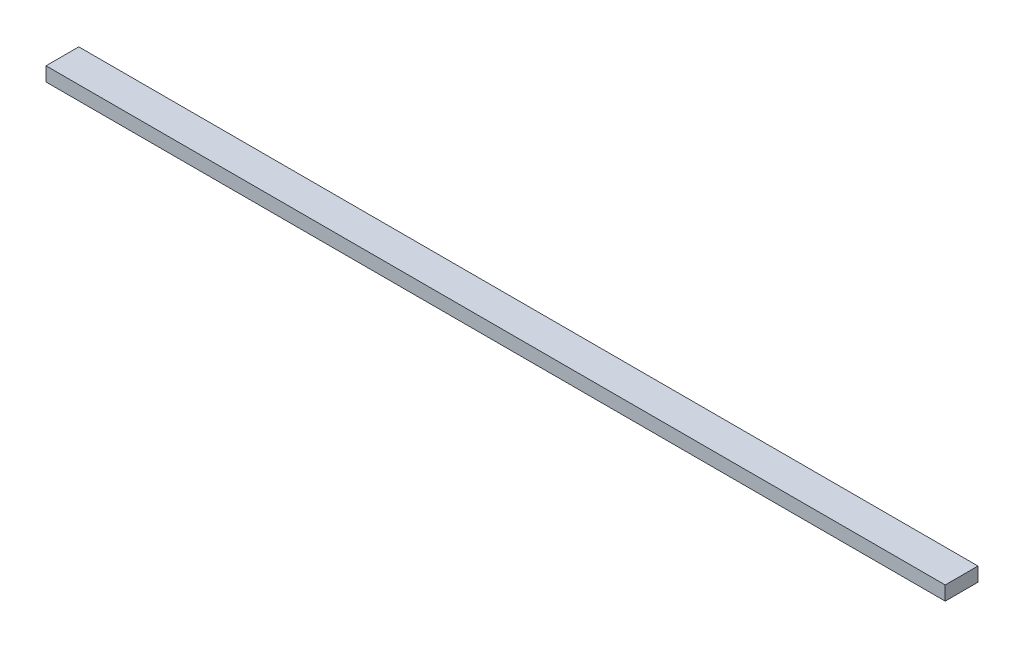
ISO-10303-21;
HEADER;
FILE_DESCRIPTION(('STEP AP214'),'2;1');
FILE_NAME('part.step','',(''),(''),'','','');
FILE_SCHEMA(('AUTOMOTIVE_DESIGN { 1 0 10303 214 1 1 1 1 }'));
ENDSEC;
DATA;
#1=APPLICATION_CONTEXT('core data for automotive mechanical design processes');
#2=APPLICATION_PROTOCOL_DEFINITION('international standard','automotive_design',2000,#1);
#3=PRODUCT_CONTEXT('',#1,'mechanical');
#4=PRODUCT('Part','Part','',(#3));
#5=PRODUCT_RELATED_PRODUCT_CATEGORY('part','',(#4));
#6=PRODUCT_DEFINITION_FORMATION('','',#4);
#7=PRODUCT_DEFINITION_CONTEXT('part definition',#1,'design');
#8=PRODUCT_DEFINITION('design','',#6,#7);
#9=PRODUCT_DEFINITION_SHAPE('','',#8);
#10=(LENGTH_UNIT() NAMED_UNIT(*) SI_UNIT(.MILLI.,.METRE.));
#11=(NAMED_UNIT(*) PLANE_ANGLE_UNIT() SI_UNIT($,.RADIAN.));
#12=(NAMED_UNIT(*) SI_UNIT($,.STERADIAN.) SOLID_ANGLE_UNIT());
#13=UNCERTAINTY_MEASURE_WITH_UNIT(LENGTH_MEASURE(1.E-05),#10,'distance_accuracy_value','');
#14=(GEOMETRIC_REPRESENTATION_CONTEXT(3) GLOBAL_UNCERTAINTY_ASSIGNED_CONTEXT((#13)) GLOBAL_UNIT_ASSIGNED_CONTEXT((#10,
#11,#12)) REPRESENTATION_CONTEXT('',''));
#15=CARTESIAN_POINT('',(0.,0.,0.));
#16=DIRECTION('',(0.,0.,1.));
#17=DIRECTION('',(1.,0.,0.));
#18=AXIS2_PLACEMENT_3D('',#15,#16,#17);
#19=CARTESIAN_POINT('',(0.,38.1,0.));
#20=DIRECTION('',(1.,0.,0.));
#21=DIRECTION('',(0.,0.,-1.));
#22=AXIS2_PLACEMENT_3D('',#19,#20,#21);
#23=PLANE('',#22);
#24=DIRECTION('',(0.,0.,1.));
#25=VECTOR('',#24,1.);
#26=CARTESIAN_POINT('',(0.,0.,0.));
#27=LINE('',#26,#25);
#28=CARTESIAN_POINT('',(0.,0.,0.));
#29=VERTEX_POINT('',#28);
#30=CARTESIAN_POINT('',(0.,4.44089209850063E-13,88.9));
#31=VERTEX_POINT('',#30);
#32=EDGE_CURVE('E91',#29,#31,#27,.T.);
#33=ORIENTED_EDGE('',*,*,#32,.T.);
#34=DIRECTION('',(0.,-1.,0.));
#35=VECTOR('',#34,1.);
#36=CARTESIAN_POINT('',(0.,38.1000000000005,88.9));
#37=LINE('',#36,#35);
#38=CARTESIAN_POINT('',(0.,38.1000000000005,88.9));
#39=VERTEX_POINT('',#38);
#40=EDGE_CURVE('E11',#39,#31,#37,.T.);
#41=ORIENTED_EDGE('',*,*,#40,.F.);
#42=DIRECTION('',(0.,0.,1.));
#43=VECTOR('',#42,1.);
#44=CARTESIAN_POINT('',(0.,38.1,0.));
#45=LINE('',#44,#43);
#46=CARTESIAN_POINT('',(0.,38.1,0.));
#47=VERTEX_POINT('',#46);
#48=EDGE_CURVE('E79',#47,#39,#45,.T.);
#49=ORIENTED_EDGE('',*,*,#48,.F.);
#50=DIRECTION('',(0.,-1.,0.));
#51=VECTOR('',#50,1.);
#52=CARTESIAN_POINT('',(0.,38.1,0.));
#53=LINE('',#52,#51);
#54=EDGE_CURVE('E87',#47,#29,#53,.T.);
#55=ORIENTED_EDGE('',*,*,#54,.T.);
#56=EDGE_LOOP('',(#33,#41,#49,#55));
#57=FACE_BOUND('',#56,.T.);
#58=ADVANCED_FACE('F28',(#57),#23,.F.);
#59=CARTESIAN_POINT('',(0.,38.1000000000005,88.9));
#60=DIRECTION('',(0.,0.,-1.));
#61=DIRECTION('',(-1.,0.,0.));
#62=AXIS2_PLACEMENT_3D('',#59,#60,#61);
#63=PLANE('',#62);
#64=DIRECTION('',(1.,0.,0.));
#65=VECTOR('',#64,1.);
#66=CARTESIAN_POINT('',(0.,4.44089209850063E-13,88.9));
#67=LINE('',#66,#65);
#68=CARTESIAN_POINT('',(2438.4,4.44089209850063E-13,88.9));
#69=VERTEX_POINT('',#68);
#70=EDGE_CURVE('E83',#31,#69,#67,.T.);
#71=ORIENTED_EDGE('',*,*,#70,.T.);
#72=DIRECTION('',(0.,-1.,0.));
#73=VECTOR('',#72,1.);
#74=CARTESIAN_POINT('',(2438.4,38.1000000000005,88.9));
#75=LINE('',#74,#73);
#76=CARTESIAN_POINT('',(2438.4,38.1000000000005,88.9));
#77=VERTEX_POINT('',#76);
#78=EDGE_CURVE('E36',#77,#69,#75,.T.);
#79=ORIENTED_EDGE('',*,*,#78,.F.);
#80=DIRECTION('',(1.,0.,0.));
#81=VECTOR('',#80,1.);
#82=CARTESIAN_POINT('',(0.,38.1000000000005,88.9));
#83=LINE('',#82,#81);
#84=EDGE_CURVE('E74',#39,#77,#83,.T.);
#85=ORIENTED_EDGE('',*,*,#84,.F.);
#86=ORIENTED_EDGE('',*,*,#40,.T.);
#87=EDGE_LOOP('',(#71,#79,#85,#86));
#88=FACE_BOUND('',#87,.T.);
#89=ADVANCED_FACE('F82',(#88),#63,.F.);
#90=CARTESIAN_POINT('',(2438.4,38.1,0.));
#91=DIRECTION('',(-1.,0.,0.));
#92=DIRECTION('',(0.,0.,1.));
#93=AXIS2_PLACEMENT_3D('',#90,#91,#92);
#94=PLANE('',#93);
#95=DIRECTION('',(0.,0.,-1.));
#96=VECTOR('',#95,1.);
#97=CARTESIAN_POINT('',(2438.4,0.,0.));
#98=LINE('',#97,#96);
#99=CARTESIAN_POINT('',(2438.4,0.,0.));
#100=VERTEX_POINT('',#99);
#101=EDGE_CURVE('E61',#69,#100,#98,.T.);
#102=ORIENTED_EDGE('',*,*,#101,.T.);
#103=DIRECTION('',(0.,-1.,0.));
#104=VECTOR('',#103,1.);
#105=CARTESIAN_POINT('',(2438.4,38.1,0.));
#106=LINE('',#105,#104);
#107=CARTESIAN_POINT('',(2438.4,38.1,0.));
#108=VERTEX_POINT('',#107);
#109=EDGE_CURVE('E84',#108,#100,#106,.T.);
#110=ORIENTED_EDGE('',*,*,#109,.F.);
#111=DIRECTION('',(0.,0.,-1.));
#112=VECTOR('',#111,1.);
#113=CARTESIAN_POINT('',(2438.4,38.1,0.));
#114=LINE('',#113,#112);
#115=EDGE_CURVE('E77',#77,#108,#114,.T.);
#116=ORIENTED_EDGE('',*,*,#115,.F.);
#117=ORIENTED_EDGE('',*,*,#78,.T.);
#118=EDGE_LOOP('',(#102,#110,#116,#117));
#119=FACE_BOUND('',#118,.T.);
#120=ADVANCED_FACE('F85',(#119),#94,.F.);
#121=CARTESIAN_POINT('',(0.,38.1,0.));
#122=DIRECTION('',(0.,0.,1.));
#123=DIRECTION('',(1.,0.,0.));
#124=AXIS2_PLACEMENT_3D('',#121,#122,#123);
#125=PLANE('',#124);
#126=DIRECTION('',(-1.,0.,0.));
#127=VECTOR('',#126,1.);
#128=CARTESIAN_POINT('',(0.,0.,0.));
#129=LINE('',#128,#127);
#130=EDGE_CURVE('E67',#100,#29,#129,.T.);
#131=ORIENTED_EDGE('',*,*,#130,.T.);
#132=ORIENTED_EDGE('',*,*,#54,.F.);
#133=DIRECTION('',(-1.,0.,0.));
#134=VECTOR('',#133,1.);
#135=CARTESIAN_POINT('',(0.,38.1,0.));
#136=LINE('',#135,#134);
#137=EDGE_CURVE('E44',#108,#47,#136,.T.);
#138=ORIENTED_EDGE('',*,*,#137,.F.);
#139=ORIENTED_EDGE('',*,*,#109,.T.);
#140=EDGE_LOOP('',(#131,#132,#138,#139));
#141=FACE_BOUND('',#140,.T.);
#142=ADVANCED_FACE('F98',(#141),#125,.F.);
#143=CARTESIAN_POINT('',(0.,38.1,0.));
#144=DIRECTION('',(0.,1.,0.));
#145=DIRECTION('',(0.,0.,1.));
#146=AXIS2_PLACEMENT_3D('',#143,#144,#145);
#147=PLANE('',#146);
#148=ORIENTED_EDGE('',*,*,#48,.T.);
#149=ORIENTED_EDGE('',*,*,#84,.T.);
#150=ORIENTED_EDGE('',*,*,#115,.T.);
#151=ORIENTED_EDGE('',*,*,#137,.T.);
#152=EDGE_LOOP('',(#148,#149,#150,#151));
#153=FACE_BOUND('',#152,.T.);
#154=ADVANCED_FACE('F75',(#153),#147,.T.);
#155=CARTESIAN_POINT('',(0.,0.,0.));
#156=DIRECTION('',(0.,1.,0.));
#157=DIRECTION('',(0.,0.,1.));
#158=AXIS2_PLACEMENT_3D('',#155,#156,#157);
#159=PLANE('',#158);
#160=ORIENTED_EDGE('',*,*,#32,.F.);
#161=ORIENTED_EDGE('',*,*,#130,.F.);
#162=ORIENTED_EDGE('',*,*,#101,.F.);
#163=ORIENTED_EDGE('',*,*,#70,.F.);
#164=EDGE_LOOP('',(#160,#161,#162,#163));
#165=FACE_BOUND('',#164,.T.);
#166=ADVANCED_FACE('F101',(#165),#159,.F.);
#167=CLOSED_SHELL('',(#58,#89,#120,#142,#154,#166));
#168=MANIFOLD_SOLID_BREP('B2',#167);
#169=ADVANCED_BREP_SHAPE_REPRESENTATION('',(#18,#168),#14);
#170=SHAPE_DEFINITION_REPRESENTATION(#9,#169);
ENDSEC;
END-ISO-10303-21;
